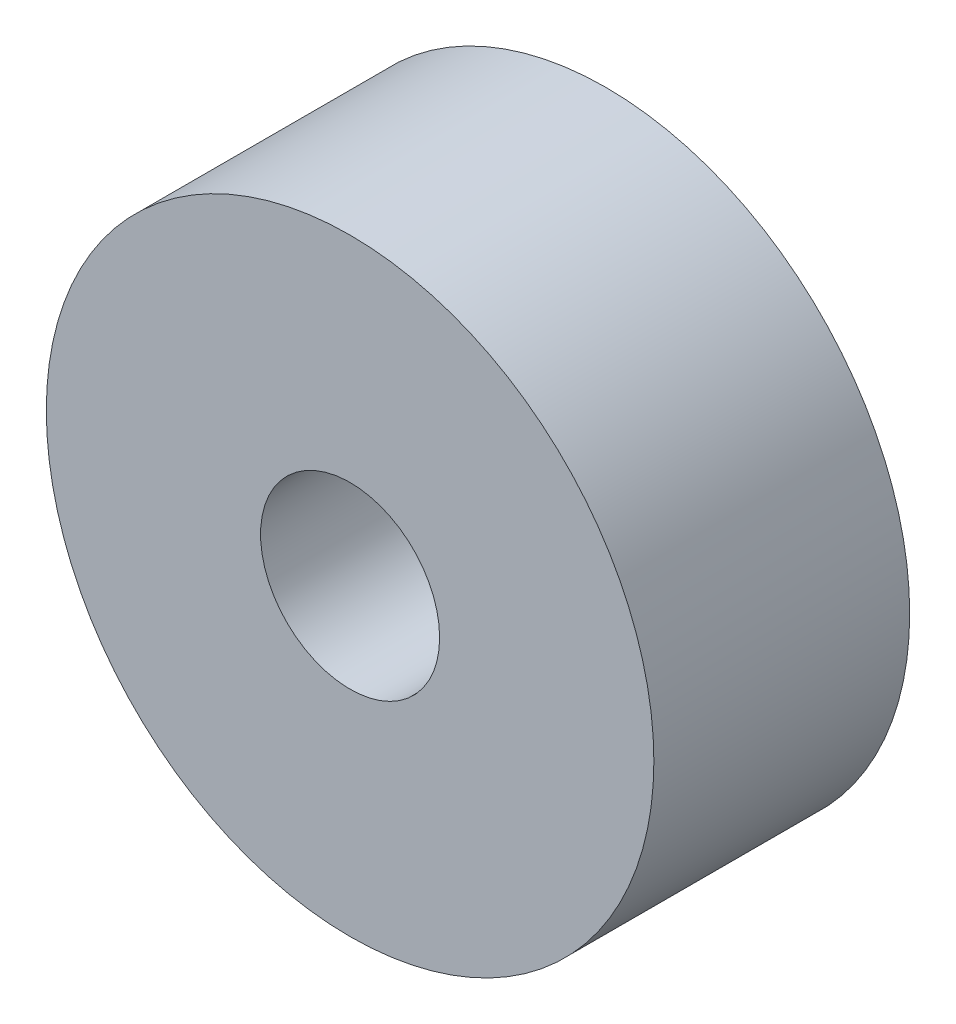
ISO-10303-21;
HEADER;
FILE_DESCRIPTION(('STEP AP214'),'2;1');
FILE_NAME('part.step','',(''),(''),'','','');
FILE_SCHEMA(('AUTOMOTIVE_DESIGN { 1 0 10303 214 1 1 1 1 }'));
ENDSEC;
DATA;
#1=APPLICATION_CONTEXT('core data for automotive mechanical design processes');
#2=APPLICATION_PROTOCOL_DEFINITION('international standard','automotive_design',2000,#1);
#3=PRODUCT_CONTEXT('',#1,'mechanical');
#4=PRODUCT('Part','Part','',(#3));
#5=PRODUCT_RELATED_PRODUCT_CATEGORY('part','',(#4));
#6=PRODUCT_DEFINITION_FORMATION('','',#4);
#7=PRODUCT_DEFINITION_CONTEXT('part definition',#1,'design');
#8=PRODUCT_DEFINITION('design','',#6,#7);
#9=PRODUCT_DEFINITION_SHAPE('','',#8);
#10=(LENGTH_UNIT() NAMED_UNIT(*) SI_UNIT(.MILLI.,.METRE.));
#11=(NAMED_UNIT(*) PLANE_ANGLE_UNIT() SI_UNIT($,.RADIAN.));
#12=(NAMED_UNIT(*) SI_UNIT($,.STERADIAN.) SOLID_ANGLE_UNIT());
#13=UNCERTAINTY_MEASURE_WITH_UNIT(LENGTH_MEASURE(1.E-05),#10,'distance_accuracy_value','');
#14=(GEOMETRIC_REPRESENTATION_CONTEXT(3) GLOBAL_UNCERTAINTY_ASSIGNED_CONTEXT((#13)) GLOBAL_UNIT_ASSIGNED_CONTEXT((#10,
#11,#12)) REPRESENTATION_CONTEXT('',''));
#15=CARTESIAN_POINT('',(0.,0.,0.));
#16=DIRECTION('',(0.,0.,1.));
#17=DIRECTION('',(1.,0.,0.));
#18=AXIS2_PLACEMENT_3D('',#15,#16,#17);
#19=CARTESIAN_POINT('',(0.,0.,8.));
#20=DIRECTION('',(0.,0.,-1.));
#21=DIRECTION('',(-1.,0.,0.));
#22=AXIS2_PLACEMENT_3D('',#19,#20,#21);
#23=CYLINDRICAL_SURFACE('',#22,9.5);
#24=CARTESIAN_POINT('',(0.,0.,8.));
#25=DIRECTION('',(0.,0.,1.));
#26=DIRECTION('',(1.,0.,0.));
#27=AXIS2_PLACEMENT_3D('',#24,#25,#26);
#28=CIRCLE('',#27,9.5);
#29=CARTESIAN_POINT('',(9.5,0.,8.));
#30=VERTEX_POINT('',#29);
#31=EDGE_CURVE('E10',#30,#30,#28,.T.);
#32=ORIENTED_EDGE('',*,*,#31,.F.);
#33=EDGE_LOOP('',(#32));
#34=FACE_BOUND('',#33,.T.);
#35=CARTESIAN_POINT('',(0.,0.,0.));
#36=DIRECTION('',(0.,0.,1.));
#37=DIRECTION('',(1.,0.,0.));
#38=AXIS2_PLACEMENT_3D('',#35,#36,#37);
#39=CIRCLE('',#38,9.5);
#40=CARTESIAN_POINT('',(9.5,0.,0.));
#41=VERTEX_POINT('',#40);
#42=EDGE_CURVE('E40',#41,#41,#39,.T.);
#43=ORIENTED_EDGE('',*,*,#42,.T.);
#44=EDGE_LOOP('',(#43));
#45=FACE_BOUND('',#44,.T.);
#46=ADVANCED_FACE('F33',(#34,#45),#23,.T.);
#47=CARTESIAN_POINT('',(0.,0.,8.));
#48=DIRECTION('',(0.,0.,1.));
#49=DIRECTION('',(1.,0.,0.));
#50=AXIS2_PLACEMENT_3D('',#47,#48,#49);
#51=PLANE('',#50);
#52=CARTESIAN_POINT('',(0.,0.,8.));
#53=DIRECTION('',(0.,0.,1.));
#54=DIRECTION('',(1.,0.,0.));
#55=AXIS2_PLACEMENT_3D('',#52,#53,#54);
#56=CIRCLE('',#55,2.8);
#57=CARTESIAN_POINT('',(2.8,0.,8.));
#58=VERTEX_POINT('',#57);
#59=EDGE_CURVE('E46',#58,#58,#56,.T.);
#60=ORIENTED_EDGE('',*,*,#59,.F.);
#61=EDGE_LOOP('',(#60));
#62=FACE_BOUND('',#61,.T.);
#63=ORIENTED_EDGE('',*,*,#31,.T.);
#64=EDGE_LOOP('',(#63));
#65=FACE_BOUND('',#64,.T.);
#66=ADVANCED_FACE('F62',(#62,#65),#51,.T.);
#67=CARTESIAN_POINT('',(0.,0.,0.));
#68=DIRECTION('',(0.,0.,1.));
#69=DIRECTION('',(1.,0.,0.));
#70=AXIS2_PLACEMENT_3D('',#67,#68,#69);
#71=PLANE('',#70);
#72=CARTESIAN_POINT('',(0.,0.,0.));
#73=DIRECTION('',(0.,0.,1.));
#74=DIRECTION('',(1.,0.,0.));
#75=AXIS2_PLACEMENT_3D('',#72,#73,#74);
#76=CIRCLE('',#75,2.8);
#77=CARTESIAN_POINT('',(2.8,0.,0.));
#78=VERTEX_POINT('',#77);
#79=EDGE_CURVE('E36',#78,#78,#76,.T.);
#80=ORIENTED_EDGE('',*,*,#79,.T.);
#81=EDGE_LOOP('',(#80));
#82=FACE_BOUND('',#81,.T.);
#83=ORIENTED_EDGE('',*,*,#42,.F.);
#84=EDGE_LOOP('',(#83));
#85=FACE_BOUND('',#84,.T.);
#86=ADVANCED_FACE('F53',(#82,#85),#71,.F.);
#87=CARTESIAN_POINT('',(0.,0.,-2.));
#88=DIRECTION('',(0.,0.,1.));
#89=DIRECTION('',(1.,0.,0.));
#90=AXIS2_PLACEMENT_3D('',#87,#88,#89);
#91=CYLINDRICAL_SURFACE('',#90,2.8);
#92=ORIENTED_EDGE('',*,*,#59,.T.);
#93=EDGE_LOOP('',(#92));
#94=FACE_BOUND('',#93,.T.);
#95=ORIENTED_EDGE('',*,*,#79,.F.);
#96=EDGE_LOOP('',(#95));
#97=FACE_BOUND('',#96,.T.);
#98=ADVANCED_FACE('F56',(#94,#97),#91,.F.);
#99=CLOSED_SHELL('',(#46,#66,#86,#98));
#100=MANIFOLD_SOLID_BREP('B2',#99);
#101=ADVANCED_BREP_SHAPE_REPRESENTATION('',(#18,#100),#14);
#102=SHAPE_DEFINITION_REPRESENTATION(#9,#101);
ENDSEC;
END-ISO-10303-21;
